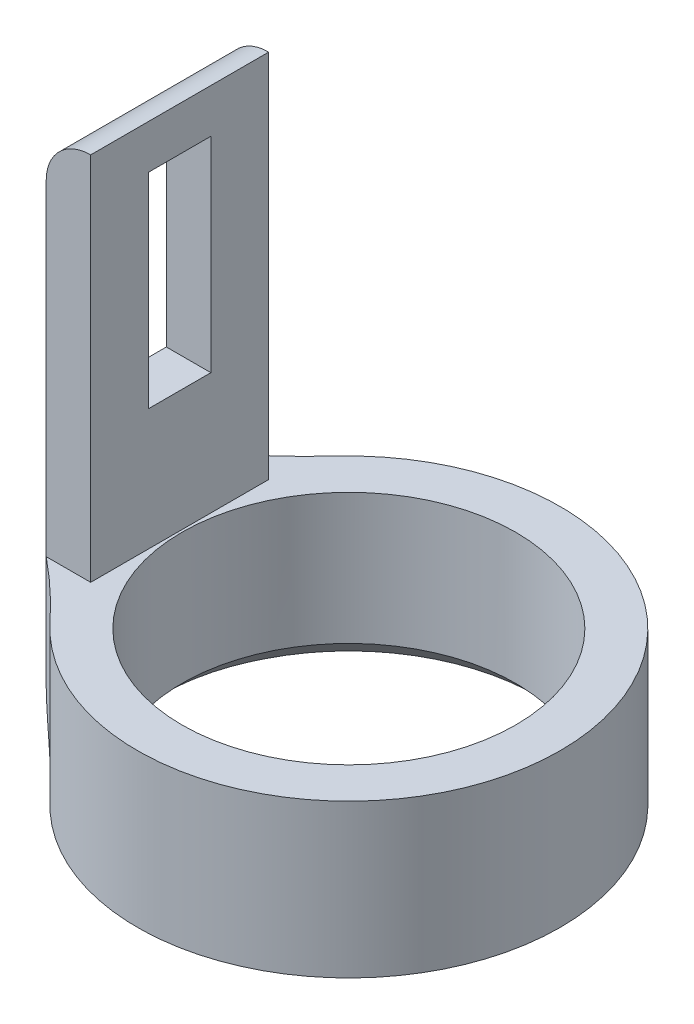
ISO-10303-21;
HEADER;
FILE_DESCRIPTION(('STEP AP214'),'2;1');
FILE_NAME('part.step','',(''),(''),'','','');
FILE_SCHEMA(('AUTOMOTIVE_DESIGN { 1 0 10303 214 1 1 1 1 }'));
ENDSEC;
DATA;
#1=APPLICATION_CONTEXT('core data for automotive mechanical design processes');
#2=APPLICATION_PROTOCOL_DEFINITION('international standard','automotive_design',2000,#1);
#3=PRODUCT_CONTEXT('',#1,'mechanical');
#4=PRODUCT('Part','Part','',(#3));
#5=PRODUCT_RELATED_PRODUCT_CATEGORY('part','',(#4));
#6=PRODUCT_DEFINITION_FORMATION('','',#4);
#7=PRODUCT_DEFINITION_CONTEXT('part definition',#1,'design');
#8=PRODUCT_DEFINITION('design','',#6,#7);
#9=PRODUCT_DEFINITION_SHAPE('','',#8);
#10=(LENGTH_UNIT() NAMED_UNIT(*) SI_UNIT(.MILLI.,.METRE.));
#11=(NAMED_UNIT(*) PLANE_ANGLE_UNIT() SI_UNIT($,.RADIAN.));
#12=(NAMED_UNIT(*) SI_UNIT($,.STERADIAN.) SOLID_ANGLE_UNIT());
#13=UNCERTAINTY_MEASURE_WITH_UNIT(LENGTH_MEASURE(1.E-05),#10,'distance_accuracy_value','');
#14=(GEOMETRIC_REPRESENTATION_CONTEXT(3) GLOBAL_UNCERTAINTY_ASSIGNED_CONTEXT((#13)) GLOBAL_UNIT_ASSIGNED_CONTEXT((#10,
#11,#12)) REPRESENTATION_CONTEXT('',''));
#15=CARTESIAN_POINT('',(0.,0.,0.));
#16=DIRECTION('',(0.,0.,1.));
#17=DIRECTION('',(1.,0.,0.));
#18=AXIS2_PLACEMENT_3D('',#15,#16,#17);
#19=CARTESIAN_POINT('',(0.,3.44,0.));
#20=DIRECTION('',(0.,1.,0.));
#21=DIRECTION('',(0.,0.,1.));
#22=AXIS2_PLACEMENT_3D('',#19,#20,#21);
#23=PLANE('',#22);
#24=CARTESIAN_POINT('',(0.,3.44,0.));
#25=DIRECTION('',(0.,1.,0.));
#26=DIRECTION('',(0.,0.,1.));
#27=AXIS2_PLACEMENT_3D('',#24,#25,#26);
#28=CIRCLE('',#27,3.75);
#29=CARTESIAN_POINT('',(0.,3.44,3.75));
#30=VERTEX_POINT('',#29);
#31=EDGE_CURVE('E194',#30,#30,#28,.T.);
#32=ORIENTED_EDGE('',*,*,#31,.F.);
#33=EDGE_LOOP('',(#32));
#34=FACE_BOUND('',#33,.T.);
#35=DIRECTION('',(0.,0.,1.));
#36=VECTOR('',#35,1.);
#37=CARTESIAN_POINT('',(-3.8,3.44,0.));
#38=LINE('',#37,#36);
#39=CARTESIAN_POINT('',(-3.8,3.44,-2.));
#40=VERTEX_POINT('',#39);
#41=CARTESIAN_POINT('',(-3.8,3.44,2.));
#42=VERTEX_POINT('',#41);
#43=EDGE_CURVE('E192',#40,#42,#38,.T.);
#44=ORIENTED_EDGE('',*,*,#43,.T.);
#45=DIRECTION('',(-1.,0.,0.));
#46=VECTOR('',#45,1.);
#47=CARTESIAN_POINT('',(0.,3.44,2.));
#48=LINE('',#47,#46);
#49=CARTESIAN_POINT('',(-4.8,3.44,2.));
#50=VERTEX_POINT('',#49);
#51=EDGE_CURVE('E189',#42,#50,#48,.T.);
#52=ORIENTED_EDGE('',*,*,#51,.T.);
#53=CARTESIAN_POINT('',(-12.9924476649849,3.44,12.0937506040364));
#54=DIRECTION('',(0.,1.,0.));
#55=DIRECTION('',(0.,0.,1.));
#56=AXIS2_PLACEMENT_3D('',#53,#54,#55);
#57=CIRCLE('',#56,13.);
#58=CARTESIAN_POINT('',(-3.4768521920382,3.44,3.23635579544635));
#59=VERTEX_POINT('',#58);
#60=EDGE_CURVE('E207',#50,#59,#57,.F.);
#61=ORIENTED_EDGE('',*,*,#60,.T.);
#62=CARTESIAN_POINT('',(0.,3.44,0.));
#63=DIRECTION('',(0.,1.,0.));
#64=DIRECTION('',(0.,0.,1.));
#65=AXIS2_PLACEMENT_3D('',#62,#63,#64);
#66=CIRCLE('',#65,4.75);
#67=CARTESIAN_POINT('',(-3.4768521920382,3.44,-3.23635579544635));
#68=VERTEX_POINT('',#67);
#69=EDGE_CURVE('E198',#59,#68,#66,.T.);
#70=ORIENTED_EDGE('',*,*,#69,.T.);
#71=CARTESIAN_POINT('',(-12.9924476649849,3.44,-12.0937506040364));
#72=DIRECTION('',(0.,1.,0.));
#73=DIRECTION('',(0.,0.,1.));
#74=AXIS2_PLACEMENT_3D('',#71,#72,#73);
#75=CIRCLE('',#74,13.);
#76=CARTESIAN_POINT('',(-4.8,3.44,-2.));
#77=VERTEX_POINT('',#76);
#78=EDGE_CURVE('E214',#68,#77,#75,.F.);
#79=ORIENTED_EDGE('',*,*,#78,.T.);
#80=DIRECTION('',(1.,0.,0.));
#81=VECTOR('',#80,1.);
#82=CARTESIAN_POINT('',(0.,3.44,-2.));
#83=LINE('',#82,#81);
#84=EDGE_CURVE('E183',#77,#40,#83,.T.);
#85=ORIENTED_EDGE('',*,*,#84,.T.);
#86=EDGE_LOOP('',(#44,#52,#61,#70,#79,#85));
#87=FACE_BOUND('',#86,.T.);
#88=ADVANCED_FACE('F32',(#34,#87),#23,.T.);
#89=CARTESIAN_POINT('',(0.,3.44,0.));
#90=DIRECTION('',(0.,-1.,0.));
#91=DIRECTION('',(0.,0.,-1.));
#92=AXIS2_PLACEMENT_3D('',#89,#90,#91);
#93=CYLINDRICAL_SURFACE('',#92,4.75);
#94=ORIENTED_EDGE('',*,*,#69,.F.);
#95=DIRECTION('',(0.,-1.,0.));
#96=VECTOR('',#95,1.);
#97=CARTESIAN_POINT('',(-3.4768521920382,3.44,3.23635579544635));
#98=LINE('',#97,#96);
#99=CARTESIAN_POINT('',(-3.4768521920382,0.,3.23635579544635));
#100=VERTEX_POINT('',#99);
#101=EDGE_CURVE('E205',#59,#100,#98,.T.);
#102=ORIENTED_EDGE('',*,*,#101,.T.);
#103=CARTESIAN_POINT('',(0.,0.,0.));
#104=DIRECTION('',(0.,1.,0.));
#105=DIRECTION('',(0.,0.,1.));
#106=AXIS2_PLACEMENT_3D('',#103,#104,#105);
#107=CIRCLE('',#106,4.75);
#108=CARTESIAN_POINT('',(-3.4768521920382,0.,-3.23635579544635));
#109=VERTEX_POINT('',#108);
#110=EDGE_CURVE('E197',#100,#109,#107,.T.);
#111=ORIENTED_EDGE('',*,*,#110,.T.);
#112=DIRECTION('',(0.,-1.,0.));
#113=VECTOR('',#112,1.);
#114=CARTESIAN_POINT('',(-3.4768521920382,3.44,-3.23635579544635));
#115=LINE('',#114,#113);
#116=EDGE_CURVE('E201',#109,#68,#115,.F.);
#117=ORIENTED_EDGE('',*,*,#116,.T.);
#118=EDGE_LOOP('',(#94,#102,#111,#117));
#119=FACE_BOUND('',#118,.T.);
#120=ADVANCED_FACE('F266',(#119),#93,.T.);
#121=CARTESIAN_POINT('',(0.,0.,0.));
#122=DIRECTION('',(0.,1.,0.));
#123=DIRECTION('',(0.,0.,1.));
#124=AXIS2_PLACEMENT_3D('',#121,#122,#123);
#125=PLANE('',#124);
#126=CARTESIAN_POINT('',(-12.9924476649849,0.,12.0937506040364));
#127=DIRECTION('',(0.,1.,0.));
#128=DIRECTION('',(0.,0.,1.));
#129=AXIS2_PLACEMENT_3D('',#126,#127,#128);
#130=CIRCLE('',#129,13.);
#131=CARTESIAN_POINT('',(-3.8,0.,2.90142195855623));
#132=VERTEX_POINT('',#131);
#133=EDGE_CURVE('E209',#100,#132,#130,.T.);
#134=ORIENTED_EDGE('',*,*,#133,.T.);
#135=DIRECTION('',(0.,0.,-1.));
#136=VECTOR('',#135,1.);
#137=CARTESIAN_POINT('',(-3.8,0.,-2.));
#138=LINE('',#137,#136);
#139=CARTESIAN_POINT('',(-3.8,0.,1.90328663106743));
#140=VERTEX_POINT('',#139);
#141=EDGE_CURVE('E225',#132,#140,#138,.T.);
#142=ORIENTED_EDGE('',*,*,#141,.T.);
#143=CARTESIAN_POINT('',(0.,0.,0.));
#144=DIRECTION('',(0.,1.,0.));
#145=DIRECTION('',(0.,0.,1.));
#146=AXIS2_PLACEMENT_3D('',#143,#144,#145);
#147=CIRCLE('',#146,4.25);
#148=CARTESIAN_POINT('',(-3.8,0.,-1.90328663106743));
#149=VERTEX_POINT('',#148);
#150=EDGE_CURVE('E217',#140,#149,#147,.T.);
#151=ORIENTED_EDGE('',*,*,#150,.T.);
#152=DIRECTION('',(0.,0.,-1.));
#153=VECTOR('',#152,1.);
#154=CARTESIAN_POINT('',(-3.8,0.,-2.));
#155=LINE('',#154,#153);
#156=CARTESIAN_POINT('',(-3.8,0.,-2.90142195855623));
#157=VERTEX_POINT('',#156);
#158=EDGE_CURVE('E223',#149,#157,#155,.T.);
#159=ORIENTED_EDGE('',*,*,#158,.T.);
#160=CARTESIAN_POINT('',(-12.9924476649849,0.,-12.0937506040364));
#161=DIRECTION('',(0.,1.,0.));
#162=DIRECTION('',(0.,0.,1.));
#163=AXIS2_PLACEMENT_3D('',#160,#161,#162);
#164=CIRCLE('',#163,13.);
#165=EDGE_CURVE('E212',#157,#109,#164,.T.);
#166=ORIENTED_EDGE('',*,*,#165,.T.);
#167=ORIENTED_EDGE('',*,*,#110,.F.);
#168=EDGE_LOOP('',(#134,#142,#151,#159,#166,#167));
#169=FACE_BOUND('',#168,.T.);
#170=ADVANCED_FACE('F282',(#169),#125,.F.);
#171=CARTESIAN_POINT('',(0.,3.44,0.));
#172=DIRECTION('',(0.,-1.,0.));
#173=DIRECTION('',(0.,0.,-1.));
#174=AXIS2_PLACEMENT_3D('',#171,#172,#173);
#175=CYLINDRICAL_SURFACE('',#174,3.75);
#176=CARTESIAN_POINT('',(0.,0.500000000000003,0.));
#177=DIRECTION('',(0.,1.,0.));
#178=DIRECTION('',(0.,0.,1.));
#179=AXIS2_PLACEMENT_3D('',#176,#177,#178);
#180=CIRCLE('',#179,3.75);
#181=CARTESIAN_POINT('',(0.,0.500000000000003,3.75));
#182=VERTEX_POINT('',#181);
#183=EDGE_CURVE('E220',#182,#182,#180,.F.);
#184=ORIENTED_EDGE('',*,*,#183,.T.);
#185=EDGE_LOOP('',(#184));
#186=FACE_BOUND('',#185,.T.);
#187=ORIENTED_EDGE('',*,*,#31,.T.);
#188=EDGE_LOOP('',(#187));
#189=FACE_BOUND('',#188,.T.);
#190=ADVANCED_FACE('F287',(#186,#189),#175,.F.);
#191=CARTESIAN_POINT('',(-3.8,0.,2.));
#192=DIRECTION('',(0.,0.,-1.));
#193=DIRECTION('',(-1.,0.,0.));
#194=AXIS2_PLACEMENT_3D('',#191,#192,#193);
#195=PLANE('',#194);
#196=DIRECTION('',(0.,-1.,0.));
#197=VECTOR('',#196,1.);
#198=CARTESIAN_POINT('',(-3.8,0.,2.));
#199=LINE('',#198,#197);
#200=CARTESIAN_POINT('',(-3.8,11.7576014508475,2.));
#201=VERTEX_POINT('',#200);
#202=EDGE_CURVE('E176',#201,#42,#199,.T.);
#203=ORIENTED_EDGE('',*,*,#202,.F.);
#204=CARTESIAN_POINT('',(-3.8,10.7576014508475,2.));
#205=DIRECTION('',(0.,0.,-1.));
#206=DIRECTION('',(-1.,0.,0.));
#207=AXIS2_PLACEMENT_3D('',#204,#205,#206);
#208=CIRCLE('',#207,1.);
#209=CARTESIAN_POINT('',(-4.8,10.7576014508475,2.));
#210=VERTEX_POINT('',#209);
#211=EDGE_CURVE('E256',#201,#210,#208,.F.);
#212=ORIENTED_EDGE('',*,*,#211,.T.);
#213=DIRECTION('',(0.,-1.,0.));
#214=VECTOR('',#213,1.);
#215=CARTESIAN_POINT('',(-4.8,0.,2.));
#216=LINE('',#215,#214);
#217=EDGE_CURVE('E184',#210,#50,#216,.T.);
#218=ORIENTED_EDGE('',*,*,#217,.T.);
#219=ORIENTED_EDGE('',*,*,#51,.F.);
#220=EDGE_LOOP('',(#203,#212,#218,#219));
#221=FACE_BOUND('',#220,.T.);
#222=ADVANCED_FACE('F294',(#221),#195,.F.);
#223=CARTESIAN_POINT('',(-3.8,0.,-2.));
#224=DIRECTION('',(0.,0.,1.));
#225=DIRECTION('',(1.,0.,0.));
#226=AXIS2_PLACEMENT_3D('',#223,#224,#225);
#227=PLANE('',#226);
#228=DIRECTION('',(0.,1.,0.));
#229=VECTOR('',#228,1.);
#230=CARTESIAN_POINT('',(-4.8,0.,-2.));
#231=LINE('',#230,#229);
#232=CARTESIAN_POINT('',(-4.8,10.7576014508475,-2.));
#233=VERTEX_POINT('',#232);
#234=EDGE_CURVE('E186',#77,#233,#231,.T.);
#235=ORIENTED_EDGE('',*,*,#234,.T.);
#236=CARTESIAN_POINT('',(-3.8,10.7576014508475,-2.));
#237=DIRECTION('',(0.,0.,1.));
#238=DIRECTION('',(1.,0.,0.));
#239=AXIS2_PLACEMENT_3D('',#236,#237,#238);
#240=CIRCLE('',#239,1.);
#241=CARTESIAN_POINT('',(-3.8,11.7576014508475,-2.));
#242=VERTEX_POINT('',#241);
#243=EDGE_CURVE('E11',#233,#242,#240,.F.);
#244=ORIENTED_EDGE('',*,*,#243,.T.);
#245=DIRECTION('',(0.,1.,0.));
#246=VECTOR('',#245,1.);
#247=CARTESIAN_POINT('',(-3.8,0.,-2.));
#248=LINE('',#247,#246);
#249=EDGE_CURVE('E180',#40,#242,#248,.T.);
#250=ORIENTED_EDGE('',*,*,#249,.F.);
#251=ORIENTED_EDGE('',*,*,#84,.F.);
#252=EDGE_LOOP('',(#235,#244,#250,#251));
#253=FACE_BOUND('',#252,.T.);
#254=ADVANCED_FACE('F348',(#253),#227,.F.);
#255=CARTESIAN_POINT('',(-3.8,0.,0.));
#256=DIRECTION('',(-1.,0.,0.));
#257=DIRECTION('',(0.,0.,1.));
#258=AXIS2_PLACEMENT_3D('',#255,#256,#257);
#259=PLANE('',#258);
#260=DIRECTION('',(0.,0.,-1.));
#261=VECTOR('',#260,1.);
#262=CARTESIAN_POINT('',(-3.8,10.7691696498165,-0.7));
#263=LINE('',#262,#261);
#264=CARTESIAN_POINT('',(-3.8,10.7691696498165,0.7));
#265=VERTEX_POINT('',#264);
#266=CARTESIAN_POINT('',(-3.8,10.7691696498165,-0.7));
#267=VERTEX_POINT('',#266);
#268=EDGE_CURVE('E145',#265,#267,#263,.T.);
#269=ORIENTED_EDGE('',*,*,#268,.T.);
#270=DIRECTION('',(0.,-1.,0.));
#271=VECTOR('',#270,1.);
#272=CARTESIAN_POINT('',(-3.8,10.7691696498165,-0.7));
#273=LINE('',#272,#271);
#274=CARTESIAN_POINT('',(-3.8,6.1691696498165,-0.7));
#275=VERTEX_POINT('',#274);
#276=EDGE_CURVE('E137',#267,#275,#273,.T.);
#277=ORIENTED_EDGE('',*,*,#276,.T.);
#278=DIRECTION('',(0.,0.,1.));
#279=VECTOR('',#278,1.);
#280=CARTESIAN_POINT('',(-3.8,6.1691696498165,0.7));
#281=LINE('',#280,#279);
#282=CARTESIAN_POINT('',(-3.8,6.1691696498165,0.7));
#283=VERTEX_POINT('',#282);
#284=EDGE_CURVE('E149',#275,#283,#281,.T.);
#285=ORIENTED_EDGE('',*,*,#284,.T.);
#286=DIRECTION('',(0.,1.,0.));
#287=VECTOR('',#286,1.);
#288=CARTESIAN_POINT('',(-3.8,10.7691696498165,0.7));
#289=LINE('',#288,#287);
#290=EDGE_CURVE('E153',#283,#265,#289,.T.);
#291=ORIENTED_EDGE('',*,*,#290,.T.);
#292=EDGE_LOOP('',(#269,#277,#285,#291));
#293=FACE_BOUND('',#292,.T.);
#294=ORIENTED_EDGE('',*,*,#43,.F.);
#295=ORIENTED_EDGE('',*,*,#249,.T.);
#296=DIRECTION('',(0.,0.,1.));
#297=VECTOR('',#296,1.);
#298=CARTESIAN_POINT('',(-3.8,11.7576014508475,-2.));
#299=LINE('',#298,#297);
#300=EDGE_CURVE('E173',#242,#201,#299,.T.);
#301=ORIENTED_EDGE('',*,*,#300,.T.);
#302=ORIENTED_EDGE('',*,*,#202,.T.);
#303=EDGE_LOOP('',(#294,#295,#301,#302));
#304=FACE_BOUND('',#303,.T.);
#305=ADVANCED_FACE('F155',(#293,#304),#259,.F.);
#306=CARTESIAN_POINT('',(-4.8,0.,0.));
#307=DIRECTION('',(-1.,0.,0.));
#308=DIRECTION('',(0.,0.,1.));
#309=AXIS2_PLACEMENT_3D('',#306,#307,#308);
#310=PLANE('',#309);
#311=CARTESIAN_POINT('',(-4.8,1.,-2.));
#312=VERTEX_POINT('',#311);
#313=EDGE_CURVE('E177',#312,#77,#231,.T.);
#314=ORIENTED_EDGE('',*,*,#313,.F.);
#315=DIRECTION('',(0.,0.,-1.));
#316=VECTOR('',#315,1.);
#317=CARTESIAN_POINT('',(-4.8,1.,2.));
#318=LINE('',#317,#316);
#319=CARTESIAN_POINT('',(-4.8,1.,2.));
#320=VERTEX_POINT('',#319);
#321=EDGE_CURVE('E257',#312,#320,#318,.F.);
#322=ORIENTED_EDGE('',*,*,#321,.T.);
#323=EDGE_CURVE('E169',#50,#320,#216,.T.);
#324=ORIENTED_EDGE('',*,*,#323,.F.);
#325=ORIENTED_EDGE('',*,*,#217,.F.);
#326=DIRECTION('',(0.,0.,1.));
#327=VECTOR('',#326,1.);
#328=CARTESIAN_POINT('',(-4.8,10.7576014508475,-2.));
#329=LINE('',#328,#327);
#330=CARTESIAN_POINT('',(-4.8,10.7576014508475,0.7));
#331=VERTEX_POINT('',#330);
#332=EDGE_CURVE('E310',#210,#331,#329,.F.);
#333=ORIENTED_EDGE('',*,*,#332,.T.);
#334=DIRECTION('',(0.,1.,0.));
#335=VECTOR('',#334,1.);
#336=CARTESIAN_POINT('',(-4.8,10.7691696498165,0.7));
#337=LINE('',#336,#335);
#338=CARTESIAN_POINT('',(-4.8,6.1691696498165,0.7));
#339=VERTEX_POINT('',#338);
#340=EDGE_CURVE('E158',#339,#331,#337,.T.);
#341=ORIENTED_EDGE('',*,*,#340,.F.);
#342=DIRECTION('',(0.,0.,1.));
#343=VECTOR('',#342,1.);
#344=CARTESIAN_POINT('',(-4.8,6.1691696498165,0.7));
#345=LINE('',#344,#343);
#346=CARTESIAN_POINT('',(-4.8,6.1691696498165,-0.7));
#347=VERTEX_POINT('',#346);
#348=EDGE_CURVE('E160',#347,#339,#345,.T.);
#349=ORIENTED_EDGE('',*,*,#348,.F.);
#350=DIRECTION('',(0.,-1.,0.));
#351=VECTOR('',#350,1.);
#352=CARTESIAN_POINT('',(-4.8,10.7691696498165,-0.7));
#353=LINE('',#352,#351);
#354=CARTESIAN_POINT('',(-4.8,10.7576014508475,-0.7));
#355=VERTEX_POINT('',#354);
#356=EDGE_CURVE('E140',#355,#347,#353,.T.);
#357=ORIENTED_EDGE('',*,*,#356,.F.);
#358=DIRECTION('',(0.,0.,1.));
#359=VECTOR('',#358,1.);
#360=CARTESIAN_POINT('',(-4.8,10.7576014508475,-2.));
#361=LINE('',#360,#359);
#362=EDGE_CURVE('E309',#355,#233,#361,.F.);
#363=ORIENTED_EDGE('',*,*,#362,.T.);
#364=ORIENTED_EDGE('',*,*,#234,.F.);
#365=EDGE_LOOP('',(#314,#322,#324,#325,#333,#341,#349,#357,#363,#364));
#366=FACE_BOUND('',#365,.T.);
#367=ADVANCED_FACE('F320',(#366),#310,.T.);
#368=CARTESIAN_POINT('',(-3.8,10.7691696498165,-0.7));
#369=DIRECTION('',(0.,0.,-1.));
#370=DIRECTION('',(0.,1.,0.));
#371=AXIS2_PLACEMENT_3D('',#368,#369,#370);
#372=PLANE('',#371);
#373=DIRECTION('',(-1.,0.,0.));
#374=VECTOR('',#373,1.);
#375=CARTESIAN_POINT('',(-3.8,10.7691696498165,-0.7));
#376=LINE('',#375,#374);
#377=CARTESIAN_POINT('',(-4.79993308614757,10.7691696498165,-0.7));
#378=VERTEX_POINT('',#377);
#379=EDGE_CURVE('E167',#267,#378,#376,.T.);
#380=ORIENTED_EDGE('',*,*,#379,.T.);
#381=CARTESIAN_POINT('',(-3.8,10.7576014508475,-0.7));
#382=DIRECTION('',(0.,0.,-1.));
#383=DIRECTION('',(0.,1.,0.));
#384=AXIS2_PLACEMENT_3D('',#381,#382,#383);
#385=CIRCLE('',#384,1.);
#386=EDGE_CURVE('E40',#378,#355,#385,.F.);
#387=ORIENTED_EDGE('',*,*,#386,.T.);
#388=ORIENTED_EDGE('',*,*,#356,.T.);
#389=DIRECTION('',(-1.,0.,0.));
#390=VECTOR('',#389,1.);
#391=CARTESIAN_POINT('',(-3.8,6.1691696498165,-0.7));
#392=LINE('',#391,#390);
#393=EDGE_CURVE('E133',#275,#347,#392,.T.);
#394=ORIENTED_EDGE('',*,*,#393,.F.);
#395=ORIENTED_EDGE('',*,*,#276,.F.);
#396=EDGE_LOOP('',(#380,#387,#388,#394,#395));
#397=FACE_BOUND('',#396,.T.);
#398=ADVANCED_FACE('F135',(#397),#372,.F.);
#399=CARTESIAN_POINT('',(-3.8,10.7691696498165,-0.7));
#400=DIRECTION('',(0.,1.,0.));
#401=DIRECTION('',(0.,0.,1.));
#402=AXIS2_PLACEMENT_3D('',#399,#400,#401);
#403=PLANE('',#402);
#404=DIRECTION('',(-1.,0.,0.));
#405=VECTOR('',#404,1.);
#406=CARTESIAN_POINT('',(-3.8,10.7691696498165,0.7));
#407=LINE('',#406,#405);
#408=CARTESIAN_POINT('',(-4.79993308614757,10.7691696498165,0.7));
#409=VERTEX_POINT('',#408);
#410=EDGE_CURVE('E170',#265,#409,#407,.T.);
#411=ORIENTED_EDGE('',*,*,#410,.T.);
#412=DIRECTION('',(0.,0.,-1.));
#413=VECTOR('',#412,1.);
#414=CARTESIAN_POINT('',(-4.79993308614757,10.7691696498165,0.7));
#415=LINE('',#414,#413);
#416=EDGE_CURVE('E47',#409,#378,#415,.T.);
#417=ORIENTED_EDGE('',*,*,#416,.T.);
#418=ORIENTED_EDGE('',*,*,#379,.F.);
#419=ORIENTED_EDGE('',*,*,#268,.F.);
#420=EDGE_LOOP('',(#411,#417,#418,#419));
#421=FACE_BOUND('',#420,.T.);
#422=ADVANCED_FACE('F334',(#421),#403,.F.);
#423=CARTESIAN_POINT('',(-3.8,10.7691696498165,0.7));
#424=DIRECTION('',(0.,0.,1.));
#425=DIRECTION('',(0.,-1.,0.));
#426=AXIS2_PLACEMENT_3D('',#423,#424,#425);
#427=PLANE('',#426);
#428=ORIENTED_EDGE('',*,*,#340,.T.);
#429=CARTESIAN_POINT('',(-3.8,10.7576014508475,0.7));
#430=DIRECTION('',(0.,0.,1.));
#431=DIRECTION('',(0.,-1.,0.));
#432=AXIS2_PLACEMENT_3D('',#429,#430,#431);
#433=CIRCLE('',#432,1.);
#434=EDGE_CURVE('E55',#331,#409,#433,.F.);
#435=ORIENTED_EDGE('',*,*,#434,.T.);
#436=ORIENTED_EDGE('',*,*,#410,.F.);
#437=ORIENTED_EDGE('',*,*,#290,.F.);
#438=DIRECTION('',(-1.,0.,0.));
#439=VECTOR('',#438,1.);
#440=CARTESIAN_POINT('',(-3.8,6.1691696498165,0.7));
#441=LINE('',#440,#439);
#442=EDGE_CURVE('E144',#283,#339,#441,.T.);
#443=ORIENTED_EDGE('',*,*,#442,.T.);
#444=EDGE_LOOP('',(#428,#435,#436,#437,#443));
#445=FACE_BOUND('',#444,.T.);
#446=ADVANCED_FACE('F333',(#445),#427,.F.);
#447=CARTESIAN_POINT('',(-3.8,6.1691696498165,0.7));
#448=DIRECTION('',(0.,-1.,0.));
#449=DIRECTION('',(0.,0.,-1.));
#450=AXIS2_PLACEMENT_3D('',#447,#448,#449);
#451=PLANE('',#450);
#452=ORIENTED_EDGE('',*,*,#348,.T.);
#453=ORIENTED_EDGE('',*,*,#442,.F.);
#454=ORIENTED_EDGE('',*,*,#284,.F.);
#455=ORIENTED_EDGE('',*,*,#393,.T.);
#456=EDGE_LOOP('',(#452,#453,#454,#455));
#457=FACE_BOUND('',#456,.T.);
#458=ADVANCED_FACE('F150',(#457),#451,.F.);
#459=CARTESIAN_POINT('',(-12.9924476649849,3.44,12.0937506040364));
#460=DIRECTION('',(0.,-1.,0.));
#461=DIRECTION('',(0.,0.,-1.));
#462=AXIS2_PLACEMENT_3D('',#459,#460,#461);
#463=CYLINDRICAL_SURFACE('',#462,13.);
#464=ORIENTED_EDGE('',*,*,#323,.T.);
#465=CARTESIAN_POINT('',(-4.8,1.,2.));
#466=CARTESIAN_POINT('',(-4.80000229745375,0.976465231891735,1.99999869888328));
#467=CARTESIAN_POINT('',(-4.79916845799314,0.952943615574026,2.00067485767028));
#468=CARTESIAN_POINT('',(-4.79585849169848,0.906104369334966,2.00336246333009));
#469=CARTESIAN_POINT('',(-4.79338317186025,0.882786644879385,2.00537325406243));
#470=CARTESIAN_POINT('',(-4.783583740392,0.813688547438606,2.01334251868422));
#471=CARTESIAN_POINT('',(-4.77388522498796,0.768435698852499,2.02123852060558));
#472=CARTESIAN_POINT('',(-4.74878716602951,0.680809488526968,2.04176975163377));
#473=CARTESIAN_POINT('',(-4.73339653710601,0.638431746145843,2.0543975704711));
#474=CARTESIAN_POINT('',(-4.69775727877134,0.557282414566316,2.08382330200988));
#475=CARTESIAN_POINT('',(-4.67750221528074,0.518515696639671,2.10062673873901));
#476=CARTESIAN_POINT('',(-4.63156863730784,0.442693965796301,2.13902041728684));
#477=CARTESIAN_POINT('',(-4.60561595145971,0.405932095597502,2.16085755955252));
#478=CARTESIAN_POINT('',(-4.55032018281688,0.337460270117397,2.20781087786224));
#479=CARTESIAN_POINT('',(-4.52097690497948,0.305750605712414,2.23292724255328));
#480=CARTESIAN_POINT('',(-4.44388263981033,0.232182305280505,2.29957957056396));
#481=CARTESIAN_POINT('',(-4.39449022276068,0.193613249656893,2.34286533891943));
#482=CARTESIAN_POINT('',(-4.29232006756237,0.127445550364793,2.43391063061447));
#483=CARTESIAN_POINT('',(-4.23952828239896,0.0998963368545652,2.48168915007972));
#484=CARTESIAN_POINT('',(-4.12207131666737,0.0507547900628077,2.5898596426399));
#485=CARTESIAN_POINT('',(-4.05708745423308,0.0313508405729535,2.65090188791861));
#486=CARTESIAN_POINT('',(-3.95999361848402,0.0123373930574237,2.74405639385483));
#487=CARTESIAN_POINT('',(-3.92784150992753,0.00768027248916347,2.77522431443043));
#488=CARTESIAN_POINT('',(-3.86374135472962,0.0015168702716261,2.83801024469137));
#489=CARTESIAN_POINT('',(-3.83179312434974,7.17119735356298E-06,2.86962772863819));
#490=CARTESIAN_POINT('',(-3.8,0.,2.90142195855623));
#491=B_SPLINE_CURVE_WITH_KNOTS('',3,(#465,#466,#467,#468,#469,#470,#471,#472,#473,#474,#475,
#476,#477,#478,#479,#480,#481,#482,#483,#484,#485,#486,#487,#488,#489,#490),.UNSPECIFIED.,.F.,
.F.,(4,2,2,2,2,2,2,2,2,2,2,2,4),(0.,0.0705545169676417,0.141074373129648,0.281145684000042,
0.420998546565701,0.561037418178278,0.710548492526907,0.860068171736496,1.08729059477522,
1.31552110594018,1.58797219253056,1.72294643691421,1.8577740517152),.UNSPECIFIED.);
#492=EDGE_CURVE('E249',#320,#132,#491,.T.);
#493=ORIENTED_EDGE('',*,*,#492,.T.);
#494=ORIENTED_EDGE('',*,*,#133,.F.);
#495=ORIENTED_EDGE('',*,*,#101,.F.);
#496=ORIENTED_EDGE('',*,*,#60,.F.);
#497=EDGE_LOOP('',(#464,#493,#494,#495,#496));
#498=FACE_BOUND('',#497,.T.);
#499=ADVANCED_FACE('F260',(#498),#463,.F.);
#500=CARTESIAN_POINT('',(-12.9924476649849,3.44,-12.0937506040364));
#501=DIRECTION('',(0.,1.,0.));
#502=DIRECTION('',(0.,0.,1.));
#503=AXIS2_PLACEMENT_3D('',#500,#501,#502);
#504=CYLINDRICAL_SURFACE('',#503,13.);
#505=ORIENTED_EDGE('',*,*,#165,.F.);
#506=CARTESIAN_POINT('',(-3.8,0.,-2.90142195855623));
#507=CARTESIAN_POINT('',(-3.82969683660631,5.1551603148872E-06,-2.87172411359019));
#508=CARTESIAN_POINT('',(-3.85953032795825,0.00132325517874109,-2.84217907860254));
#509=CARTESIAN_POINT('',(-3.91937853670301,0.00669491170890005,-2.78347801776367));
#510=CARTESIAN_POINT('',(-3.94939337958842,0.010750647663531,-2.75432232073936));
#511=CARTESIAN_POINT('',(-4.03994090943822,0.0272663049450899,-2.66721123007201));
#512=CARTESIAN_POINT('',(-4.10053696738647,0.0440780982917149,-2.61005127983853));
#513=CARTESIAN_POINT('',(-4.21373875164986,0.0878059691663734,-2.50523779126729));
#514=CARTESIAN_POINT('',(-4.26650320791328,0.113441643346319,-2.45722285037729));
#515=CARTESIAN_POINT('',(-4.36906123288063,0.175533411886347,-2.36534309143849));
#516=CARTESIAN_POINT('',(-4.41886308396839,0.211957455928876,-2.32146648116396));
#517=CARTESIAN_POINT('',(-4.50292317486736,0.287018718792764,-2.24842815523873));
#518=CARTESIAN_POINT('',(-4.53819692651889,0.323424340640632,-2.21814823834755));
#519=CARTESIAN_POINT('',(-4.60411567601272,0.403283922114177,-2.16209654492244));
#520=CARTESIAN_POINT('',(-4.63476434946939,0.446732227251355,-2.13632118595029));
#521=CARTESIAN_POINT('',(-4.6850139460171,0.532264868115187,-2.09437896602192));
#522=CARTESIAN_POINT('',(-4.70560713763013,0.573327592944012,-2.07732370577852));
#523=CARTESIAN_POINT('',(-4.74131506373341,0.659288277918702,-2.04788838090274));
#524=CARTESIAN_POINT('',(-4.75643913163857,0.704179541015511,-2.03550034981345));
#525=CARTESIAN_POINT('',(-4.77869197109757,0.790539334956661,-2.01732280050571));
#526=CARTESIAN_POINT('',(-4.78662093759853,0.831659585446952,-2.01087119419727));
#527=CARTESIAN_POINT('',(-4.79461556328393,0.894232988870613,-2.00437205657934));
#528=CARTESIAN_POINT('',(-4.79663075073971,0.91529437538089,-2.00273530988263));
#529=CARTESIAN_POINT('',(-4.79932413357271,0.957567509617666,-2.0005485224838));
#530=CARTESIAN_POINT('',(-4.80000175390007,0.97877931808258,-1.99999894918149));
#531=CARTESIAN_POINT('',(-4.8,1.,-2.00000000000001));
#532=B_SPLINE_CURVE_WITH_KNOTS('',3,(#506,#507,#508,#509,#510,#511,#512,#513,#514,#515,#516,
#517,#518,#519,#520,#521,#522,#523,#524,#525,#526,#527,#528,#529,#530,#531),.UNSPECIFIED.,.F.,
.F.,(4,2,2,2,2,2,2,2,2,2,2,2,4),(0.,0.125947401175845,0.251995188021618,0.505940845048389,
0.732588981942174,0.958570428364345,1.1350622101825,1.31141298437449,1.45781268645115,
1.60396135553761,1.73051152720711,1.79411115836962,1.8577381264774),.UNSPECIFIED.);
#533=EDGE_CURVE('E234',#157,#312,#532,.T.);
#534=ORIENTED_EDGE('',*,*,#533,.T.);
#535=ORIENTED_EDGE('',*,*,#313,.T.);
#536=ORIENTED_EDGE('',*,*,#78,.F.);
#537=ORIENTED_EDGE('',*,*,#116,.F.);
#538=EDGE_LOOP('',(#505,#534,#535,#536,#537));
#539=FACE_BOUND('',#538,.T.);
#540=ADVANCED_FACE('F264',(#539),#504,.F.);
#541=CARTESIAN_POINT('',(0.,0.,0.));
#542=DIRECTION('',(0.,-1.,0.));
#543=DIRECTION('',(0.,0.,-1.));
#544=AXIS2_PLACEMENT_3D('',#541,#542,#543);
#545=CONICAL_SURFACE('',#544,4.25,0.785398163397444);
#546=ORIENTED_EDGE('',*,*,#183,.F.);
#547=EDGE_LOOP('',(#546));
#548=FACE_BOUND('',#547,.T.);
#549=ORIENTED_EDGE('',*,*,#150,.F.);
#550=CARTESIAN_POINT('',(-3.8,0.,1.90328663106743));
#551=CARTESIAN_POINT('',(-3.81754411876684,8.82234499885677E-06,1.86823989384283));
#552=CARTESIAN_POINT('',(-3.83419869006586,0.000460970412701064,1.83276753539281));
#553=CARTESIAN_POINT('',(-3.865881345979,0.00204460193602052,1.76114105940795));
#554=CARTESIAN_POINT('',(-3.88091037471053,0.00317568853546441,1.72498735208667));
#555=CARTESIAN_POINT('',(-3.9237467778693,0.0072710221690091,1.61587428612766));
#556=CARTESIAN_POINT('',(-3.9493877216879,0.0109394166453656,1.5420900104846));
#557=CARTESIAN_POINT('',(-3.99579012453195,0.0190727026154493,1.39301538787222));
#558=CARTESIAN_POINT('',(-4.0165476806202,0.0235382262175865,1.31772388808142));
#559=CARTESIAN_POINT('',(-4.05379852532212,0.0325547697430543,1.16603890564045));
#560=CARTESIAN_POINT('',(-4.0702879400877,0.0371058633415204,1.08964448788112));
#561=CARTESIAN_POINT('',(-4.1121916072029,0.0495429290625076,0.868965925444453));
#562=CARTESIAN_POINT('',(-4.13280366974949,0.056865574366581,0.723723896061941));
#563=CARTESIAN_POINT('',(-4.16237516998017,0.0678407486092658,0.431937038437832));
#564=CARTESIAN_POINT('',(-4.17133186490697,0.0714924136417289,0.285391911715243));
#565=CARTESIAN_POINT('',(-4.17827667803435,0.0742996602044145,-0.00821454721548672));
#566=CARTESIAN_POINT('',(-4.1762487828292,0.0734486777883023,-0.155276320548496));
#567=CARTESIAN_POINT('',(-4.16103989573358,0.0674102827323778,-0.448757129053941));
#568=CARTESIAN_POINT('',(-4.14785893416355,0.0622228818814459,-0.595176165972616));
#569=CARTESIAN_POINT('',(-4.11525222423941,0.0508927247619025,-0.841097963394907));
#570=CARTESIAN_POINT('',(-4.0990301749009,0.0455449633357037,-0.941070477586609));
#571=CARTESIAN_POINT('',(-4.06009747143312,0.0342008197458595,-1.13963064284504));
#572=CARTESIAN_POINT('',(-4.03739404967639,0.0282051651559728,-1.23821970972189));
#573=CARTESIAN_POINT('',(-3.99771374617828,0.0196490613777438,-1.38444502658588));
#574=CARTESIAN_POINT('',(-3.98357263787835,0.016873425126057,-1.43284528910234));
#575=CARTESIAN_POINT('',(-3.95322283517618,0.0116883149501663,-1.52900275071171));
#576=CARTESIAN_POINT('',(-3.93701473265422,0.00927873663701592,-1.57676012958215));
#577=CARTESIAN_POINT('',(-3.90224755379775,0.00508444193189443,-1.67162394370238));
#578=CARTESIAN_POINT('',(-3.88368113948056,0.00330174431287609,-1.71872781505003));
#579=CARTESIAN_POINT('',(-3.8439028061791,0.000771826395047382,-1.81188293412197));
#580=CARTESIAN_POINT('',(-3.82268828676778,2.56327964931218E-05,-1.85793309376931));
#581=CARTESIAN_POINT('',(-3.8,0.,-1.90328663106743));
#582=B_SPLINE_CURVE_WITH_KNOTS('',3,(#550,#551,#552,#553,#554,#555,#556,#557,#558,#559,#560,
#561,#562,#563,#564,#565,#566,#567,#568,#569,#570,#571,#572,#573,#574,#575,#576,#577,#578,#579,
#580,#581),.UNSPECIFIED.,.F.,.F.,(4,2,2,2,2,2,2,2,2,2,2,2,2,2,2,4),(0.,0.117536488900323,
0.235004341660487,0.469364847668947,0.703912029470921,0.938671350256014,1.37868851084327,
1.81880919816648,2.25957166875953,2.70033294111045,3.00442383657191,3.30817672348778,
3.45963903869368,3.61105807989908,3.76296037094362,3.91501302047359),.UNSPECIFIED.);
#583=EDGE_CURVE('E228',#140,#149,#582,.T.);
#584=ORIENTED_EDGE('',*,*,#583,.T.);
#585=EDGE_LOOP('',(#549,#584));
#586=FACE_BOUND('',#585,.T.);
#587=ADVANCED_FACE('F240',(#548,#586),#545,.F.);
#588=CARTESIAN_POINT('',(-3.8,1.,0.));
#589=DIRECTION('',(0.,0.,1.));
#590=DIRECTION('',(1.,0.,0.));
#591=AXIS2_PLACEMENT_3D('',#588,#589,#590);
#592=CYLINDRICAL_SURFACE('',#591,1.);
#593=ORIENTED_EDGE('',*,*,#492,.F.);
#594=ORIENTED_EDGE('',*,*,#321,.F.);
#595=ORIENTED_EDGE('',*,*,#533,.F.);
#596=ORIENTED_EDGE('',*,*,#158,.F.);
#597=ORIENTED_EDGE('',*,*,#583,.F.);
#598=ORIENTED_EDGE('',*,*,#141,.F.);
#599=EDGE_LOOP('',(#593,#594,#595,#596,#597,#598));
#600=FACE_BOUND('',#599,.T.);
#601=ADVANCED_FACE('F242',(#600),#592,.T.);
#602=CARTESIAN_POINT('',(-3.8,10.7576014508475,-2.));
#603=DIRECTION('',(0.,0.,-1.));
#604=DIRECTION('',(-1.,0.,0.));
#605=AXIS2_PLACEMENT_3D('',#602,#603,#604);
#606=CYLINDRICAL_SURFACE('',#605,1.);
#607=ORIENTED_EDGE('',*,*,#434,.F.);
#608=ORIENTED_EDGE('',*,*,#332,.F.);
#609=ORIENTED_EDGE('',*,*,#211,.F.);
#610=ORIENTED_EDGE('',*,*,#300,.F.);
#611=ORIENTED_EDGE('',*,*,#243,.F.);
#612=ORIENTED_EDGE('',*,*,#362,.F.);
#613=ORIENTED_EDGE('',*,*,#386,.F.);
#614=ORIENTED_EDGE('',*,*,#416,.F.);
#615=EDGE_LOOP('',(#607,#608,#609,#610,#611,#612,#613,#614));
#616=FACE_BOUND('',#615,.T.);
#617=ADVANCED_FACE('F34',(#616),#606,.T.);
#618=CLOSED_SHELL('',(#88,#120,#170,#190,#222,#254,#305,#367,#398,#422,#446,#458,#499,#540,#587,
#601,#617));
#619=MANIFOLD_SOLID_BREP('B2',#618);
#620=ADVANCED_BREP_SHAPE_REPRESENTATION('',(#18,#619),#14);
#621=SHAPE_DEFINITION_REPRESENTATION(#9,#620);
ENDSEC;
END-ISO-10303-21;
